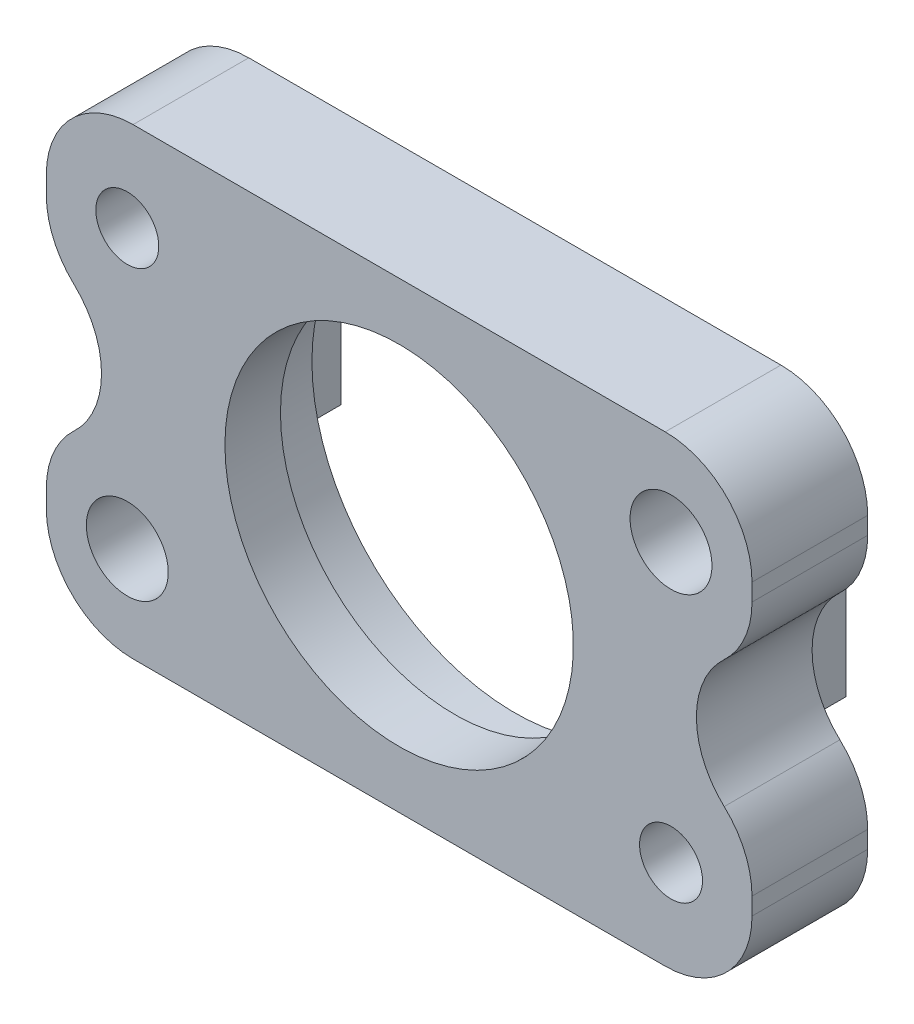
ISO-10303-21;
HEADER;
FILE_DESCRIPTION(('STEP AP214'),'2;1');
FILE_NAME('part.step','',(''),(''),'','','');
FILE_SCHEMA(('AUTOMOTIVE_DESIGN { 1 0 10303 214 1 1 1 1 }'));
ENDSEC;
DATA;
#1=APPLICATION_CONTEXT('core data for automotive mechanical design processes');
#2=APPLICATION_PROTOCOL_DEFINITION('international standard','automotive_design',2000,#1);
#3=PRODUCT_CONTEXT('',#1,'mechanical');
#4=PRODUCT('Part','Part','',(#3));
#5=PRODUCT_RELATED_PRODUCT_CATEGORY('part','',(#4));
#6=PRODUCT_DEFINITION_FORMATION('','',#4);
#7=PRODUCT_DEFINITION_CONTEXT('part definition',#1,'design');
#8=PRODUCT_DEFINITION('design','',#6,#7);
#9=PRODUCT_DEFINITION_SHAPE('','',#8);
#10=(LENGTH_UNIT() NAMED_UNIT(*) SI_UNIT(.MILLI.,.METRE.));
#11=(NAMED_UNIT(*) PLANE_ANGLE_UNIT() SI_UNIT($,.RADIAN.));
#12=(NAMED_UNIT(*) SI_UNIT($,.STERADIAN.) SOLID_ANGLE_UNIT());
#13=UNCERTAINTY_MEASURE_WITH_UNIT(LENGTH_MEASURE(1.E-05),#10,'distance_accuracy_value','');
#14=(GEOMETRIC_REPRESENTATION_CONTEXT(3) GLOBAL_UNCERTAINTY_ASSIGNED_CONTEXT((#13)) GLOBAL_UNIT_ASSIGNED_CONTEXT((#10,
#11,#12)) REPRESENTATION_CONTEXT('',''));
#15=CARTESIAN_POINT('',(0.,0.,0.));
#16=DIRECTION('',(0.,0.,1.));
#17=DIRECTION('',(1.,0.,0.));
#18=AXIS2_PLACEMENT_3D('',#15,#16,#17);
#19=CARTESIAN_POINT('',(0.,0.,0.));
#20=DIRECTION('',(0.,0.,1.));
#21=DIRECTION('',(1.,0.,0.));
#22=AXIS2_PLACEMENT_3D('',#19,#20,#21);
#23=PLANE('',#22);
#24=CARTESIAN_POINT('',(-219.71,17.78,0.));
#25=DIRECTION('',(0.,0.,1.));
#26=DIRECTION('',(1.,0.,0.));
#27=AXIS2_PLACEMENT_3D('',#24,#25,#26);
#28=CIRCLE('',#27,1.72720000000001);
#29=CARTESIAN_POINT('',(-217.9828,17.78,0.));
#30=VERTEX_POINT('',#29);
#31=EDGE_CURVE('E322',#30,#30,#28,.T.);
#32=ORIENTED_EDGE('',*,*,#31,.T.);
#33=EDGE_LOOP('',(#32));
#34=FACE_BOUND('',#33,.T.);
#35=CARTESIAN_POINT('',(-249.555,33.02,0.));
#36=DIRECTION('',(0.,0.,1.));
#37=DIRECTION('',(1.,0.,0.));
#38=AXIS2_PLACEMENT_3D('',#35,#36,#37);
#39=CIRCLE('',#38,1.72720000000001);
#40=CARTESIAN_POINT('',(-247.8278,33.02,0.));
#41=VERTEX_POINT('',#40);
#42=EDGE_CURVE('E318',#41,#41,#39,.T.);
#43=ORIENTED_EDGE('',*,*,#42,.T.);
#44=EDGE_LOOP('',(#43));
#45=FACE_BOUND('',#44,.T.);
#46=CARTESIAN_POINT('',(-249.555,17.78,0.));
#47=DIRECTION('',(0.,0.,1.));
#48=DIRECTION('',(1.,0.,0.));
#49=AXIS2_PLACEMENT_3D('',#46,#47,#48);
#50=CIRCLE('',#49,2.2479);
#51=CARTESIAN_POINT('',(-247.3071,17.78,0.));
#52=VERTEX_POINT('',#51);
#53=EDGE_CURVE('E796',#52,#52,#50,.T.);
#54=ORIENTED_EDGE('',*,*,#53,.T.);
#55=EDGE_LOOP('',(#54));
#56=FACE_BOUND('',#55,.T.);
#57=CARTESIAN_POINT('',(-219.71,33.02,0.));
#58=DIRECTION('',(0.,0.,1.));
#59=DIRECTION('',(1.,0.,0.));
#60=AXIS2_PLACEMENT_3D('',#57,#58,#59);
#61=CIRCLE('',#60,2.2479);
#62=CARTESIAN_POINT('',(-217.4621,33.02,0.));
#63=VERTEX_POINT('',#62);
#64=EDGE_CURVE('E792',#63,#63,#61,.T.);
#65=ORIENTED_EDGE('',*,*,#64,.T.);
#66=EDGE_LOOP('',(#65));
#67=FACE_BOUND('',#66,.T.);
#68=CARTESIAN_POINT('',(-234.6325,25.4,0.));
#69=DIRECTION('',(0.,0.,-1.));
#70=DIRECTION('',(-1.,0.,0.));
#71=AXIS2_PLACEMENT_3D('',#68,#69,#70);
#72=CIRCLE('',#71,11.1379);
#73=CARTESIAN_POINT('',(-245.7704,25.4,0.));
#74=VERTEX_POINT('',#73);
#75=EDGE_CURVE('E788',#74,#74,#72,.T.);
#76=ORIENTED_EDGE('',*,*,#75,.F.);
#77=EDGE_LOOP('',(#76));
#78=FACE_BOUND('',#77,.T.);
#79=DIRECTION('',(0.,1.,0.));
#80=VECTOR('',#79,1.);
#81=CARTESIAN_POINT('',(-221.9071,29.845,0.));
#82=LINE('',#81,#80);
#83=CARTESIAN_POINT('',(-221.9071,20.955,0.));
#84=VERTEX_POINT('',#83);
#85=CARTESIAN_POINT('',(-221.9071,29.845,0.));
#86=VERTEX_POINT('',#85);
#87=EDGE_CURVE('E221',#84,#86,#82,.T.);
#88=ORIENTED_EDGE('',*,*,#87,.F.);
#89=DIRECTION('',(-1.,0.,0.));
#90=VECTOR('',#89,1.);
#91=CARTESIAN_POINT('',(-221.9071,20.955,0.));
#92=LINE('',#91,#90);
#93=CARTESIAN_POINT('',(-219.6211,20.955,0.));
#94=VERTEX_POINT('',#93);
#95=EDGE_CURVE('E238',#94,#84,#92,.T.);
#96=ORIENTED_EDGE('',*,*,#95,.F.);
#97=DIRECTION('',(0.,-1.,0.));
#98=VECTOR('',#97,1.);
#99=CARTESIAN_POINT('',(-219.6211,20.955,0.));
#100=LINE('',#99,#98);
#101=CARTESIAN_POINT('',(-219.6211,29.845,0.));
#102=VERTEX_POINT('',#101);
#103=EDGE_CURVE('E250',#102,#94,#100,.T.);
#104=ORIENTED_EDGE('',*,*,#103,.F.);
#105=DIRECTION('',(1.,0.,0.));
#106=VECTOR('',#105,1.);
#107=CARTESIAN_POINT('',(-219.6211,29.845,0.));
#108=LINE('',#107,#106);
#109=EDGE_CURVE('E226',#86,#102,#108,.T.);
#110=ORIENTED_EDGE('',*,*,#109,.F.);
#111=EDGE_LOOP('',(#88,#96,#104,#110));
#112=FACE_BOUND('',#111,.T.);
#113=DIRECTION('',(0.,-1.,0.));
#114=VECTOR('',#113,1.);
#115=CARTESIAN_POINT('',(-254.,38.1,0.));
#116=LINE('',#115,#114);
#117=CARTESIAN_POINT('',(-254.,18.4270461422848,0.));
#118=VERTEX_POINT('',#117);
#119=CARTESIAN_POINT('',(-254.,17.4625,0.));
#120=VERTEX_POINT('',#119);
#121=EDGE_CURVE('E297',#118,#120,#116,.T.);
#122=ORIENTED_EDGE('',*,*,#121,.F.);
#123=CARTESIAN_POINT('',(-249.2375,18.4270461422848,0.));
#124=DIRECTION('',(0.,0.,1.));
#125=DIRECTION('',(1.,0.,0.));
#126=AXIS2_PLACEMENT_3D('',#123,#124,#125);
#127=CIRCLE('',#126,4.7625);
#128=CARTESIAN_POINT('',(-252.486843762027,21.9088806251652,0.));
#129=VERTEX_POINT('',#128);
#130=EDGE_CURVE('E343',#118,#129,#127,.F.);
#131=ORIENTED_EDGE('',*,*,#130,.T.);
#132=CARTESIAN_POINT('',(-255.744852440753,25.4,0.));
#133=DIRECTION('',(0.,0.,-1.));
#134=DIRECTION('',(-1.,0.,0.));
#135=AXIS2_PLACEMENT_3D('',#132,#133,#134);
#136=CIRCLE('',#135,4.7752);
#137=CARTESIAN_POINT('',(-252.486843762027,28.8911193748348,0.));
#138=VERTEX_POINT('',#137);
#139=EDGE_CURVE('E264',#138,#129,#136,.T.);
#140=ORIENTED_EDGE('',*,*,#139,.F.);
#141=CARTESIAN_POINT('',(-249.2375,32.3729538577152,0.));
#142=DIRECTION('',(0.,0.,1.));
#143=DIRECTION('',(1.,0.,0.));
#144=AXIS2_PLACEMENT_3D('',#141,#142,#143);
#145=CIRCLE('',#144,4.7625);
#146=CARTESIAN_POINT('',(-254.,32.3729538577152,0.));
#147=VERTEX_POINT('',#146);
#148=EDGE_CURVE('E341',#138,#147,#145,.F.);
#149=ORIENTED_EDGE('',*,*,#148,.T.);
#150=CARTESIAN_POINT('',(-254.,33.3375,0.));
#151=VERTEX_POINT('',#150);
#152=EDGE_CURVE('E300',#151,#147,#116,.T.);
#153=ORIENTED_EDGE('',*,*,#152,.F.);
#154=CARTESIAN_POINT('',(-249.2375,33.3375,0.));
#155=DIRECTION('',(0.,0.,1.));
#156=DIRECTION('',(1.,0.,0.));
#157=AXIS2_PLACEMENT_3D('',#154,#155,#156);
#158=CIRCLE('',#157,4.7625);
#159=CARTESIAN_POINT('',(-249.2375,38.1,0.));
#160=VERTEX_POINT('',#159);
#161=EDGE_CURVE('E334',#151,#160,#158,.F.);
#162=ORIENTED_EDGE('',*,*,#161,.T.);
#163=DIRECTION('',(-1.,0.,0.));
#164=VECTOR('',#163,1.);
#165=CARTESIAN_POINT('',(-215.265,38.1,0.));
#166=LINE('',#165,#164);
#167=CARTESIAN_POINT('',(-220.0275,38.1,0.));
#168=VERTEX_POINT('',#167);
#169=EDGE_CURVE('E306',#168,#160,#166,.T.);
#170=ORIENTED_EDGE('',*,*,#169,.F.);
#171=CARTESIAN_POINT('',(-220.0275,33.3375,0.));
#172=DIRECTION('',(0.,0.,1.));
#173=DIRECTION('',(1.,0.,0.));
#174=AXIS2_PLACEMENT_3D('',#171,#172,#173);
#175=CIRCLE('',#174,4.7625);
#176=CARTESIAN_POINT('',(-215.265,33.3375,0.));
#177=VERTEX_POINT('',#176);
#178=EDGE_CURVE('E337',#168,#177,#175,.F.);
#179=ORIENTED_EDGE('',*,*,#178,.T.);
#180=DIRECTION('',(0.,1.,0.));
#181=VECTOR('',#180,1.);
#182=CARTESIAN_POINT('',(-215.265,12.7,0.));
#183=LINE('',#182,#181);
#184=CARTESIAN_POINT('',(-215.265,32.3882107441622,0.));
#185=VERTEX_POINT('',#184);
#186=EDGE_CURVE('E303',#185,#177,#183,.T.);
#187=ORIENTED_EDGE('',*,*,#186,.F.);
#188=CARTESIAN_POINT('',(-220.0275,32.3882107441622,0.));
#189=DIRECTION('',(0.,0.,1.));
#190=DIRECTION('',(1.,0.,0.));
#191=AXIS2_PLACEMENT_3D('',#188,#189,#190);
#192=CIRCLE('',#191,4.76249999999995);
#193=CARTESIAN_POINT('',(-216.791355086867,28.8941053720811,0.));
#194=VERTEX_POINT('',#193);
#195=EDGE_CURVE('E270',#194,#185,#192,.T.);
#196=ORIENTED_EDGE('',*,*,#195,.F.);
#197=CARTESIAN_POINT('',(-213.555210173735,25.4,0.));
#198=DIRECTION('',(0.,0.,-1.));
#199=DIRECTION('',(-1.,0.,0.));
#200=AXIS2_PLACEMENT_3D('',#197,#198,#199);
#201=CIRCLE('',#200,4.76249999999994);
#202=CARTESIAN_POINT('',(-216.791355086867,21.9058946279189,0.));
#203=VERTEX_POINT('',#202);
#204=EDGE_CURVE('E274',#203,#194,#201,.T.);
#205=ORIENTED_EDGE('',*,*,#204,.F.);
#206=CARTESIAN_POINT('',(-220.0275,18.4117892558378,0.));
#207=DIRECTION('',(0.,0.,1.));
#208=DIRECTION('',(1.,0.,0.));
#209=AXIS2_PLACEMENT_3D('',#206,#207,#208);
#210=CIRCLE('',#209,4.76249999999995);
#211=CARTESIAN_POINT('',(-215.265,18.4117892558378,0.));
#212=VERTEX_POINT('',#211);
#213=EDGE_CURVE('E285',#212,#203,#210,.T.);
#214=ORIENTED_EDGE('',*,*,#213,.F.);
#215=CARTESIAN_POINT('',(-215.265,17.4625,0.));
#216=VERTEX_POINT('',#215);
#217=EDGE_CURVE('E302',#216,#212,#183,.T.);
#218=ORIENTED_EDGE('',*,*,#217,.F.);
#219=CARTESIAN_POINT('',(-220.0275,17.4625,0.));
#220=DIRECTION('',(0.,0.,1.));
#221=DIRECTION('',(1.,0.,0.));
#222=AXIS2_PLACEMENT_3D('',#219,#220,#221);
#223=CIRCLE('',#222,4.7625);
#224=CARTESIAN_POINT('',(-220.0275,12.7,0.));
#225=VERTEX_POINT('',#224);
#226=EDGE_CURVE('E338',#216,#225,#223,.F.);
#227=ORIENTED_EDGE('',*,*,#226,.T.);
#228=DIRECTION('',(1.,0.,0.));
#229=VECTOR('',#228,1.);
#230=CARTESIAN_POINT('',(-254.,12.7,0.));
#231=LINE('',#230,#229);
#232=CARTESIAN_POINT('',(-249.2375,12.7,0.));
#233=VERTEX_POINT('',#232);
#234=EDGE_CURVE('E299',#233,#225,#231,.T.);
#235=ORIENTED_EDGE('',*,*,#234,.F.);
#236=CARTESIAN_POINT('',(-249.2375,17.4625,0.));
#237=DIRECTION('',(0.,0.,1.));
#238=DIRECTION('',(1.,0.,0.));
#239=AXIS2_PLACEMENT_3D('',#236,#237,#238);
#240=CIRCLE('',#239,4.7625);
#241=EDGE_CURVE('E336',#233,#120,#240,.F.);
#242=ORIENTED_EDGE('',*,*,#241,.T.);
#243=EDGE_LOOP('',(#122,#131,#140,#149,#153,#162,#170,#179,#187,#196,#205,#214,#218,#227,#235,#242));
#244=FACE_BOUND('',#243,.T.);
#245=DIRECTION('',(0.,1.,0.));
#246=VECTOR('',#245,1.);
#247=CARTESIAN_POINT('',(-249.6439,29.845,0.));
#248=LINE('',#247,#246);
#249=CARTESIAN_POINT('',(-249.6439,20.955,0.));
#250=VERTEX_POINT('',#249);
#251=CARTESIAN_POINT('',(-249.6439,29.845,0.));
#252=VERTEX_POINT('',#251);
#253=EDGE_CURVE('E224',#250,#252,#248,.T.);
#254=ORIENTED_EDGE('',*,*,#253,.F.);
#255=DIRECTION('',(-1.,0.,0.));
#256=VECTOR('',#255,1.);
#257=CARTESIAN_POINT('',(-249.6439,20.955,0.));
#258=LINE('',#257,#256);
#259=CARTESIAN_POINT('',(-247.3579,20.955,0.));
#260=VERTEX_POINT('',#259);
#261=EDGE_CURVE('E222',#260,#250,#258,.T.);
#262=ORIENTED_EDGE('',*,*,#261,.F.);
#263=DIRECTION('',(0.,-1.,0.));
#264=VECTOR('',#263,1.);
#265=CARTESIAN_POINT('',(-247.3579,20.955,0.));
#266=LINE('',#265,#264);
#267=CARTESIAN_POINT('',(-247.3579,29.845,0.));
#268=VERTEX_POINT('',#267);
#269=EDGE_CURVE('E766',#268,#260,#266,.T.);
#270=ORIENTED_EDGE('',*,*,#269,.F.);
#271=DIRECTION('',(1.,0.,0.));
#272=VECTOR('',#271,1.);
#273=CARTESIAN_POINT('',(-247.3579,29.845,0.));
#274=LINE('',#273,#272);
#275=EDGE_CURVE('E767',#252,#268,#274,.T.);
#276=ORIENTED_EDGE('',*,*,#275,.F.);
#277=EDGE_LOOP('',(#254,#262,#270,#276));
#278=FACE_BOUND('',#277,.T.);
#279=ADVANCED_FACE('F39',(#34,#45,#56,#67,#78,#112,#244,#278),#23,.F.);
#280=CARTESIAN_POINT('',(-254.,38.1,0.));
#281=DIRECTION('',(-1.,0.,0.));
#282=DIRECTION('',(0.,0.,1.));
#283=AXIS2_PLACEMENT_3D('',#280,#281,#282);
#284=PLANE('',#283);
#285=ORIENTED_EDGE('',*,*,#152,.T.);
#286=DIRECTION('',(0.,0.,1.));
#287=VECTOR('',#286,1.);
#288=CARTESIAN_POINT('',(-254.,32.3729538577152,6.35));
#289=LINE('',#288,#287);
#290=CARTESIAN_POINT('',(-254.,32.3729538577152,6.35));
#291=VERTEX_POINT('',#290);
#292=EDGE_CURVE('E53',#147,#291,#289,.T.);
#293=ORIENTED_EDGE('',*,*,#292,.T.);
#294=DIRECTION('',(0.,-1.,0.));
#295=VECTOR('',#294,1.);
#296=CARTESIAN_POINT('',(-254.,38.1,6.35));
#297=LINE('',#296,#295);
#298=CARTESIAN_POINT('',(-254.,33.3375,6.35));
#299=VERTEX_POINT('',#298);
#300=EDGE_CURVE('E309',#299,#291,#297,.T.);
#301=ORIENTED_EDGE('',*,*,#300,.F.);
#302=DIRECTION('',(0.,0.,1.));
#303=VECTOR('',#302,1.);
#304=CARTESIAN_POINT('',(-254.,33.3375,0.));
#305=LINE('',#304,#303);
#306=EDGE_CURVE('E365',#299,#151,#305,.F.);
#307=ORIENTED_EDGE('',*,*,#306,.T.);
#308=EDGE_LOOP('',(#285,#293,#301,#307));
#309=FACE_BOUND('',#308,.T.);
#310=ADVANCED_FACE('F402',(#309),#284,.T.);
#311=CARTESIAN_POINT('',(-215.265,12.7,0.));
#312=DIRECTION('',(1.,0.,0.));
#313=DIRECTION('',(0.,0.,-1.));
#314=AXIS2_PLACEMENT_3D('',#311,#312,#313);
#315=PLANE('',#314);
#316=DIRECTION('',(0.,1.,0.));
#317=VECTOR('',#316,1.);
#318=CARTESIAN_POINT('',(-215.265,12.7,6.35));
#319=LINE('',#318,#317);
#320=CARTESIAN_POINT('',(-215.265,17.4625,6.35));
#321=VERTEX_POINT('',#320);
#322=CARTESIAN_POINT('',(-215.265,18.4117892558378,6.35));
#323=VERTEX_POINT('',#322);
#324=EDGE_CURVE('E317',#321,#323,#319,.T.);
#325=ORIENTED_EDGE('',*,*,#324,.F.);
#326=DIRECTION('',(0.,0.,1.));
#327=VECTOR('',#326,1.);
#328=CARTESIAN_POINT('',(-215.265,17.4625,0.));
#329=LINE('',#328,#327);
#330=EDGE_CURVE('E369',#321,#216,#329,.F.);
#331=ORIENTED_EDGE('',*,*,#330,.T.);
#332=ORIENTED_EDGE('',*,*,#217,.T.);
#333=DIRECTION('',(0.,0.,-1.));
#334=VECTOR('',#333,1.);
#335=CARTESIAN_POINT('',(-215.265,18.4117892558378,6.35));
#336=LINE('',#335,#334);
#337=EDGE_CURVE('E292',#323,#212,#336,.T.);
#338=ORIENTED_EDGE('',*,*,#337,.F.);
#339=EDGE_LOOP('',(#325,#331,#332,#338));
#340=FACE_BOUND('',#339,.T.);
#341=ADVANCED_FACE('F437',(#340),#315,.T.);
#342=CARTESIAN_POINT('',(-254.,18.4270461422848,6.35));
#343=VERTEX_POINT('',#342);
#344=CARTESIAN_POINT('',(-254.,17.4625,6.35));
#345=VERTEX_POINT('',#344);
#346=EDGE_CURVE('E289',#343,#345,#297,.T.);
#347=ORIENTED_EDGE('',*,*,#346,.F.);
#348=DIRECTION('',(0.,0.,1.));
#349=VECTOR('',#348,1.);
#350=CARTESIAN_POINT('',(-254.,18.4270461422848,0.));
#351=LINE('',#350,#349);
#352=EDGE_CURVE('E332',#343,#118,#351,.F.);
#353=ORIENTED_EDGE('',*,*,#352,.T.);
#354=ORIENTED_EDGE('',*,*,#121,.T.);
#355=DIRECTION('',(0.,0.,1.));
#356=VECTOR('',#355,1.);
#357=CARTESIAN_POINT('',(-254.,17.4625,0.));
#358=LINE('',#357,#356);
#359=EDGE_CURVE('E307',#120,#345,#358,.T.);
#360=ORIENTED_EDGE('',*,*,#359,.T.);
#361=EDGE_LOOP('',(#347,#353,#354,#360));
#362=FACE_BOUND('',#361,.T.);
#363=ADVANCED_FACE('F418',(#362),#284,.T.);
#364=CARTESIAN_POINT('',(-215.265,38.1,0.));
#365=DIRECTION('',(0.,1.,0.));
#366=DIRECTION('',(0.,0.,1.));
#367=AXIS2_PLACEMENT_3D('',#364,#365,#366);
#368=PLANE('',#367);
#369=DIRECTION('',(-1.,0.,0.));
#370=VECTOR('',#369,1.);
#371=CARTESIAN_POINT('',(-215.265,38.1,6.35));
#372=LINE('',#371,#370);
#373=CARTESIAN_POINT('',(-220.0275,38.1,6.35));
#374=VERTEX_POINT('',#373);
#375=CARTESIAN_POINT('',(-249.2375,38.1,6.35));
#376=VERTEX_POINT('',#375);
#377=EDGE_CURVE('E319',#374,#376,#372,.T.);
#378=ORIENTED_EDGE('',*,*,#377,.F.);
#379=DIRECTION('',(0.,0.,1.));
#380=VECTOR('',#379,1.);
#381=CARTESIAN_POINT('',(-220.0275,38.1,0.));
#382=LINE('',#381,#380);
#383=EDGE_CURVE('E11',#374,#168,#382,.F.);
#384=ORIENTED_EDGE('',*,*,#383,.T.);
#385=ORIENTED_EDGE('',*,*,#169,.T.);
#386=DIRECTION('',(0.,0.,1.));
#387=VECTOR('',#386,1.);
#388=CARTESIAN_POINT('',(-249.2375,38.1,0.));
#389=LINE('',#388,#387);
#390=EDGE_CURVE('E50',#160,#376,#389,.T.);
#391=ORIENTED_EDGE('',*,*,#390,.T.);
#392=EDGE_LOOP('',(#378,#384,#385,#391));
#393=FACE_BOUND('',#392,.T.);
#394=ADVANCED_FACE('F377',(#393),#368,.T.);
#395=ORIENTED_EDGE('',*,*,#186,.T.);
#396=DIRECTION('',(0.,0.,1.));
#397=VECTOR('',#396,1.);
#398=CARTESIAN_POINT('',(-215.265,33.3375,0.));
#399=LINE('',#398,#397);
#400=CARTESIAN_POINT('',(-215.265,33.3375,6.35));
#401=VERTEX_POINT('',#400);
#402=EDGE_CURVE('E375',#177,#401,#399,.T.);
#403=ORIENTED_EDGE('',*,*,#402,.T.);
#404=CARTESIAN_POINT('',(-215.265,32.3882107441622,6.35));
#405=VERTEX_POINT('',#404);
#406=EDGE_CURVE('E314',#405,#401,#319,.T.);
#407=ORIENTED_EDGE('',*,*,#406,.F.);
#408=DIRECTION('',(0.,0.,-1.));
#409=VECTOR('',#408,1.);
#410=CARTESIAN_POINT('',(-215.265,32.3882107441622,6.35));
#411=LINE('',#410,#409);
#412=EDGE_CURVE('E277',#405,#185,#411,.T.);
#413=ORIENTED_EDGE('',*,*,#412,.T.);
#414=EDGE_LOOP('',(#395,#403,#407,#413));
#415=FACE_BOUND('',#414,.T.);
#416=ADVANCED_FACE('F395',(#415),#315,.T.);
#417=CARTESIAN_POINT('',(-254.,12.7,0.));
#418=DIRECTION('',(0.,-1.,0.));
#419=DIRECTION('',(1.,0.,0.));
#420=AXIS2_PLACEMENT_3D('',#417,#418,#419);
#421=PLANE('',#420);
#422=ORIENTED_EDGE('',*,*,#234,.T.);
#423=DIRECTION('',(0.,0.,1.));
#424=VECTOR('',#423,1.);
#425=CARTESIAN_POINT('',(-220.0275,12.7,0.));
#426=LINE('',#425,#424);
#427=CARTESIAN_POINT('',(-220.0275,12.7,6.35));
#428=VERTEX_POINT('',#427);
#429=EDGE_CURVE('E370',#225,#428,#426,.T.);
#430=ORIENTED_EDGE('',*,*,#429,.T.);
#431=DIRECTION('',(1.,0.,0.));
#432=VECTOR('',#431,1.);
#433=CARTESIAN_POINT('',(-254.,12.7,6.35));
#434=LINE('',#433,#432);
#435=CARTESIAN_POINT('',(-249.2375,12.7,6.35));
#436=VERTEX_POINT('',#435);
#437=EDGE_CURVE('E315',#436,#428,#434,.T.);
#438=ORIENTED_EDGE('',*,*,#437,.F.);
#439=DIRECTION('',(0.,0.,1.));
#440=VECTOR('',#439,1.);
#441=CARTESIAN_POINT('',(-249.2375,12.7,0.));
#442=LINE('',#441,#440);
#443=EDGE_CURVE('E362',#436,#233,#442,.F.);
#444=ORIENTED_EDGE('',*,*,#443,.T.);
#445=EDGE_LOOP('',(#422,#430,#438,#444));
#446=FACE_BOUND('',#445,.T.);
#447=ADVANCED_FACE('F424',(#446),#421,.T.);
#448=CARTESIAN_POINT('',(0.,0.,6.35));
#449=DIRECTION('',(0.,0.,1.));
#450=DIRECTION('',(1.,0.,0.));
#451=AXIS2_PLACEMENT_3D('',#448,#449,#450);
#452=PLANE('',#451);
#453=CARTESIAN_POINT('',(-219.71,17.78,6.35));
#454=DIRECTION('',(0.,0.,1.));
#455=DIRECTION('',(1.,0.,0.));
#456=AXIS2_PLACEMENT_3D('',#453,#454,#455);
#457=CIRCLE('',#456,1.72720000000001);
#458=CARTESIAN_POINT('',(-217.9828,17.78,6.35));
#459=VERTEX_POINT('',#458);
#460=EDGE_CURVE('E329',#459,#459,#457,.T.);
#461=ORIENTED_EDGE('',*,*,#460,.F.);
#462=EDGE_LOOP('',(#461));
#463=FACE_BOUND('',#462,.T.);
#464=CARTESIAN_POINT('',(-249.555,33.02,6.35));
#465=DIRECTION('',(0.,0.,1.));
#466=DIRECTION('',(1.,0.,0.));
#467=AXIS2_PLACEMENT_3D('',#464,#465,#466);
#468=CIRCLE('',#467,1.72720000000001);
#469=CARTESIAN_POINT('',(-247.8278,33.02,6.35));
#470=VERTEX_POINT('',#469);
#471=EDGE_CURVE('E323',#470,#470,#468,.T.);
#472=ORIENTED_EDGE('',*,*,#471,.F.);
#473=EDGE_LOOP('',(#472));
#474=FACE_BOUND('',#473,.T.);
#475=CARTESIAN_POINT('',(-249.555,17.78,6.35));
#476=DIRECTION('',(0.,0.,1.));
#477=DIRECTION('',(1.,0.,0.));
#478=AXIS2_PLACEMENT_3D('',#475,#476,#477);
#479=CIRCLE('',#478,2.2479);
#480=CARTESIAN_POINT('',(-247.3071,17.78,6.35));
#481=VERTEX_POINT('',#480);
#482=EDGE_CURVE('E325',#481,#481,#479,.T.);
#483=ORIENTED_EDGE('',*,*,#482,.F.);
#484=EDGE_LOOP('',(#483));
#485=FACE_BOUND('',#484,.T.);
#486=CARTESIAN_POINT('',(-219.71,33.02,6.35));
#487=DIRECTION('',(0.,0.,1.));
#488=DIRECTION('',(1.,0.,0.));
#489=AXIS2_PLACEMENT_3D('',#486,#487,#488);
#490=CIRCLE('',#489,2.2479);
#491=CARTESIAN_POINT('',(-217.4621,33.02,6.35));
#492=VERTEX_POINT('',#491);
#493=EDGE_CURVE('E794',#492,#492,#490,.T.);
#494=ORIENTED_EDGE('',*,*,#493,.F.);
#495=EDGE_LOOP('',(#494));
#496=FACE_BOUND('',#495,.T.);
#497=CARTESIAN_POINT('',(-234.6325,25.4,6.34999999999999));
#498=DIRECTION('',(0.,0.,-1.));
#499=DIRECTION('',(-1.,0.,0.));
#500=AXIS2_PLACEMENT_3D('',#497,#498,#499);
#501=CIRCLE('',#500,9.56310000000002);
#502=CARTESIAN_POINT('',(-244.1956,25.4,6.34999999999999));
#503=VERTEX_POINT('',#502);
#504=EDGE_CURVE('E776',#503,#503,#501,.T.);
#505=ORIENTED_EDGE('',*,*,#504,.T.);
#506=EDGE_LOOP('',(#505));
#507=FACE_BOUND('',#506,.T.);
#508=CARTESIAN_POINT('',(-255.744852440753,25.4,6.35));
#509=DIRECTION('',(0.,0.,-1.));
#510=DIRECTION('',(-1.,0.,0.));
#511=AXIS2_PLACEMENT_3D('',#508,#509,#510);
#512=CIRCLE('',#511,4.7752);
#513=CARTESIAN_POINT('',(-252.486843762027,28.8911193748348,6.35));
#514=VERTEX_POINT('',#513);
#515=CARTESIAN_POINT('',(-252.486843762027,21.9088806251652,6.35));
#516=VERTEX_POINT('',#515);
#517=EDGE_CURVE('E261',#514,#516,#512,.T.);
#518=ORIENTED_EDGE('',*,*,#517,.T.);
#519=CARTESIAN_POINT('',(-249.2375,18.4270461422848,6.35));
#520=DIRECTION('',(0.,0.,1.));
#521=DIRECTION('',(1.,0.,0.));
#522=AXIS2_PLACEMENT_3D('',#519,#520,#521);
#523=CIRCLE('',#522,4.7625);
#524=EDGE_CURVE('E359',#516,#343,#523,.T.);
#525=ORIENTED_EDGE('',*,*,#524,.T.);
#526=ORIENTED_EDGE('',*,*,#346,.T.);
#527=CARTESIAN_POINT('',(-249.2375,17.4625,6.35));
#528=DIRECTION('',(0.,0.,1.));
#529=DIRECTION('',(1.,0.,0.));
#530=AXIS2_PLACEMENT_3D('',#527,#528,#529);
#531=CIRCLE('',#530,4.7625);
#532=EDGE_CURVE('E354',#345,#436,#531,.T.);
#533=ORIENTED_EDGE('',*,*,#532,.T.);
#534=ORIENTED_EDGE('',*,*,#437,.T.);
#535=CARTESIAN_POINT('',(-220.0275,17.4625,6.35));
#536=DIRECTION('',(0.,0.,1.));
#537=DIRECTION('',(1.,0.,0.));
#538=AXIS2_PLACEMENT_3D('',#535,#536,#537);
#539=CIRCLE('',#538,4.7625);
#540=EDGE_CURVE('E358',#428,#321,#539,.T.);
#541=ORIENTED_EDGE('',*,*,#540,.T.);
#542=ORIENTED_EDGE('',*,*,#324,.T.);
#543=CARTESIAN_POINT('',(-220.0275,18.4117892558378,6.35));
#544=DIRECTION('',(0.,0.,1.));
#545=DIRECTION('',(1.,0.,0.));
#546=AXIS2_PLACEMENT_3D('',#543,#544,#545);
#547=CIRCLE('',#546,4.76249999999995);
#548=CARTESIAN_POINT('',(-216.791355086867,21.9058946279189,6.35));
#549=VERTEX_POINT('',#548);
#550=EDGE_CURVE('E271',#323,#549,#547,.T.);
#551=ORIENTED_EDGE('',*,*,#550,.T.);
#552=CARTESIAN_POINT('',(-213.555210173735,25.4,6.35));
#553=DIRECTION('',(0.,0.,-1.));
#554=DIRECTION('',(-1.,0.,0.));
#555=AXIS2_PLACEMENT_3D('',#552,#553,#554);
#556=CIRCLE('',#555,4.76249999999994);
#557=CARTESIAN_POINT('',(-216.791355086867,28.8941053720811,6.35));
#558=VERTEX_POINT('',#557);
#559=EDGE_CURVE('E276',#549,#558,#556,.T.);
#560=ORIENTED_EDGE('',*,*,#559,.T.);
#561=CARTESIAN_POINT('',(-220.0275,32.3882107441622,6.35));
#562=DIRECTION('',(0.,0.,1.));
#563=DIRECTION('',(1.,0.,0.));
#564=AXIS2_PLACEMENT_3D('',#561,#562,#563);
#565=CIRCLE('',#564,4.76249999999995);
#566=EDGE_CURVE('E266',#558,#405,#565,.T.);
#567=ORIENTED_EDGE('',*,*,#566,.T.);
#568=ORIENTED_EDGE('',*,*,#406,.T.);
#569=CARTESIAN_POINT('',(-220.0275,33.3375,6.35));
#570=DIRECTION('',(0.,0.,1.));
#571=DIRECTION('',(1.,0.,0.));
#572=AXIS2_PLACEMENT_3D('',#569,#570,#571);
#573=CIRCLE('',#572,4.7625);
#574=EDGE_CURVE('E355',#401,#374,#573,.T.);
#575=ORIENTED_EDGE('',*,*,#574,.T.);
#576=ORIENTED_EDGE('',*,*,#377,.T.);
#577=CARTESIAN_POINT('',(-249.2375,33.3375,6.35));
#578=DIRECTION('',(0.,0.,1.));
#579=DIRECTION('',(1.,0.,0.));
#580=AXIS2_PLACEMENT_3D('',#577,#578,#579);
#581=CIRCLE('',#580,4.7625);
#582=EDGE_CURVE('E64',#376,#299,#581,.T.);
#583=ORIENTED_EDGE('',*,*,#582,.T.);
#584=ORIENTED_EDGE('',*,*,#300,.T.);
#585=CARTESIAN_POINT('',(-249.2375,32.3729538577152,6.35));
#586=DIRECTION('',(0.,0.,1.));
#587=DIRECTION('',(1.,0.,0.));
#588=AXIS2_PLACEMENT_3D('',#585,#586,#587);
#589=CIRCLE('',#588,4.7625);
#590=EDGE_CURVE('E356',#291,#514,#589,.T.);
#591=ORIENTED_EDGE('',*,*,#590,.T.);
#592=EDGE_LOOP('',(#518,#525,#526,#533,#534,#541,#542,#551,#560,#567,#568,#575,#576,#583,#584,#591));
#593=FACE_BOUND('',#592,.T.);
#594=ADVANCED_FACE('F384',(#463,#474,#485,#496,#507,#593),#452,.T.);
#595=CARTESIAN_POINT('',(-220.0275,32.3882107441622,6.35));
#596=DIRECTION('',(0.,0.,-1.));
#597=DIRECTION('',(-1.,0.,0.));
#598=AXIS2_PLACEMENT_3D('',#595,#596,#597);
#599=CYLINDRICAL_SURFACE('',#598,4.76249999999995);
#600=ORIENTED_EDGE('',*,*,#195,.T.);
#601=ORIENTED_EDGE('',*,*,#412,.F.);
#602=ORIENTED_EDGE('',*,*,#566,.F.);
#603=DIRECTION('',(0.,0.,-1.));
#604=VECTOR('',#603,1.);
#605=CARTESIAN_POINT('',(-216.791355086867,28.8941053720811,6.35));
#606=LINE('',#605,#604);
#607=EDGE_CURVE('E290',#558,#194,#606,.T.);
#608=ORIENTED_EDGE('',*,*,#607,.T.);
#609=EDGE_LOOP('',(#600,#601,#602,#608));
#610=FACE_BOUND('',#609,.T.);
#611=ADVANCED_FACE('F449',(#610),#599,.T.);
#612=CARTESIAN_POINT('',(-213.555210173735,25.4,6.35));
#613=DIRECTION('',(0.,0.,-1.));
#614=DIRECTION('',(-1.,0.,0.));
#615=AXIS2_PLACEMENT_3D('',#612,#613,#614);
#616=CYLINDRICAL_SURFACE('',#615,4.76249999999994);
#617=ORIENTED_EDGE('',*,*,#204,.T.);
#618=ORIENTED_EDGE('',*,*,#607,.F.);
#619=ORIENTED_EDGE('',*,*,#559,.F.);
#620=DIRECTION('',(0.,0.,-1.));
#621=VECTOR('',#620,1.);
#622=CARTESIAN_POINT('',(-216.791355086867,21.9058946279189,6.35));
#623=LINE('',#622,#621);
#624=EDGE_CURVE('E286',#549,#203,#623,.T.);
#625=ORIENTED_EDGE('',*,*,#624,.T.);
#626=EDGE_LOOP('',(#617,#618,#619,#625));
#627=FACE_BOUND('',#626,.T.);
#628=ADVANCED_FACE('F444',(#627),#616,.F.);
#629=CARTESIAN_POINT('',(-220.0275,18.4117892558378,6.35));
#630=DIRECTION('',(0.,0.,-1.));
#631=DIRECTION('',(-1.,0.,0.));
#632=AXIS2_PLACEMENT_3D('',#629,#630,#631);
#633=CYLINDRICAL_SURFACE('',#632,4.76249999999995);
#634=ORIENTED_EDGE('',*,*,#213,.T.);
#635=ORIENTED_EDGE('',*,*,#624,.F.);
#636=ORIENTED_EDGE('',*,*,#550,.F.);
#637=ORIENTED_EDGE('',*,*,#337,.T.);
#638=EDGE_LOOP('',(#634,#635,#636,#637));
#639=FACE_BOUND('',#638,.T.);
#640=ADVANCED_FACE('F445',(#639),#633,.T.);
#641=CARTESIAN_POINT('',(-255.744852440753,25.4,6.35));
#642=DIRECTION('',(0.,0.,-1.));
#643=DIRECTION('',(-1.,0.,0.));
#644=AXIS2_PLACEMENT_3D('',#641,#642,#643);
#645=CYLINDRICAL_SURFACE('',#644,4.7752);
#646=ORIENTED_EDGE('',*,*,#139,.T.);
#647=DIRECTION('',(0.,0.,-1.));
#648=VECTOR('',#647,1.);
#649=CARTESIAN_POINT('',(-252.486843762027,21.9088806251652,6.35));
#650=LINE('',#649,#648);
#651=EDGE_CURVE('E346',#129,#516,#650,.F.);
#652=ORIENTED_EDGE('',*,*,#651,.T.);
#653=ORIENTED_EDGE('',*,*,#517,.F.);
#654=DIRECTION('',(0.,0.,-1.));
#655=VECTOR('',#654,1.);
#656=CARTESIAN_POINT('',(-252.486843762027,28.8911193748348,6.35));
#657=LINE('',#656,#655);
#658=EDGE_CURVE('E347',#514,#138,#657,.T.);
#659=ORIENTED_EDGE('',*,*,#658,.T.);
#660=EDGE_LOOP('',(#646,#652,#653,#659));
#661=FACE_BOUND('',#660,.T.);
#662=ADVANCED_FACE('F408',(#661),#645,.F.);
#663=CARTESIAN_POINT('',(-221.9071,29.845,-3.175));
#664=DIRECTION('',(1.,0.,0.));
#665=DIRECTION('',(0.,0.,-1.));
#666=AXIS2_PLACEMENT_3D('',#663,#664,#665);
#667=PLANE('',#666);
#668=ORIENTED_EDGE('',*,*,#87,.T.);
#669=DIRECTION('',(0.,0.,1.));
#670=VECTOR('',#669,1.);
#671=CARTESIAN_POINT('',(-221.9071,29.845,-3.175));
#672=LINE('',#671,#670);
#673=CARTESIAN_POINT('',(-221.9071,29.845,-3.175));
#674=VERTEX_POINT('',#673);
#675=EDGE_CURVE('E257',#674,#86,#672,.T.);
#676=ORIENTED_EDGE('',*,*,#675,.F.);
#677=DIRECTION('',(0.,1.,0.));
#678=VECTOR('',#677,1.);
#679=CARTESIAN_POINT('',(-221.9071,29.845,-3.175));
#680=LINE('',#679,#678);
#681=CARTESIAN_POINT('',(-221.9071,20.955,-3.175));
#682=VERTEX_POINT('',#681);
#683=EDGE_CURVE('E234',#682,#674,#680,.T.);
#684=ORIENTED_EDGE('',*,*,#683,.F.);
#685=DIRECTION('',(0.,0.,1.));
#686=VECTOR('',#685,1.);
#687=CARTESIAN_POINT('',(-221.9071,20.955,-3.175));
#688=LINE('',#687,#686);
#689=EDGE_CURVE('E243',#682,#84,#688,.T.);
#690=ORIENTED_EDGE('',*,*,#689,.T.);
#691=EDGE_LOOP('',(#668,#676,#684,#690));
#692=FACE_BOUND('',#691,.T.);
#693=ADVANCED_FACE('F677',(#692),#667,.F.);
#694=CARTESIAN_POINT('',(-219.6211,29.845,-3.175));
#695=DIRECTION('',(0.,-1.,0.));
#696=DIRECTION('',(0.,0.,-1.));
#697=AXIS2_PLACEMENT_3D('',#694,#695,#696);
#698=PLANE('',#697);
#699=ORIENTED_EDGE('',*,*,#109,.T.);
#700=DIRECTION('',(0.,0.,1.));
#701=VECTOR('',#700,1.);
#702=CARTESIAN_POINT('',(-219.6211,29.845,-3.175));
#703=LINE('',#702,#701);
#704=CARTESIAN_POINT('',(-219.6211,29.845,-3.175));
#705=VERTEX_POINT('',#704);
#706=EDGE_CURVE('E256',#705,#102,#703,.T.);
#707=ORIENTED_EDGE('',*,*,#706,.F.);
#708=DIRECTION('',(1.,0.,0.));
#709=VECTOR('',#708,1.);
#710=CARTESIAN_POINT('',(-219.6211,29.845,-3.175));
#711=LINE('',#710,#709);
#712=EDGE_CURVE('E240',#674,#705,#711,.T.);
#713=ORIENTED_EDGE('',*,*,#712,.F.);
#714=ORIENTED_EDGE('',*,*,#675,.T.);
#715=EDGE_LOOP('',(#699,#707,#713,#714));
#716=FACE_BOUND('',#715,.T.);
#717=ADVANCED_FACE('F669',(#716),#698,.F.);
#718=CARTESIAN_POINT('',(-219.6211,20.955,-3.175));
#719=DIRECTION('',(-1.,0.,0.));
#720=DIRECTION('',(0.,0.,1.));
#721=AXIS2_PLACEMENT_3D('',#718,#719,#720);
#722=PLANE('',#721);
#723=ORIENTED_EDGE('',*,*,#103,.T.);
#724=DIRECTION('',(0.,0.,1.));
#725=VECTOR('',#724,1.);
#726=CARTESIAN_POINT('',(-219.6211,20.955,-3.175));
#727=LINE('',#726,#725);
#728=CARTESIAN_POINT('',(-219.6211,20.955,-3.175));
#729=VERTEX_POINT('',#728);
#730=EDGE_CURVE('E251',#729,#94,#727,.T.);
#731=ORIENTED_EDGE('',*,*,#730,.F.);
#732=DIRECTION('',(0.,-1.,0.));
#733=VECTOR('',#732,1.);
#734=CARTESIAN_POINT('',(-219.6211,20.955,-3.175));
#735=LINE('',#734,#733);
#736=EDGE_CURVE('E239',#705,#729,#735,.T.);
#737=ORIENTED_EDGE('',*,*,#736,.F.);
#738=ORIENTED_EDGE('',*,*,#706,.T.);
#739=EDGE_LOOP('',(#723,#731,#737,#738));
#740=FACE_BOUND('',#739,.T.);
#741=ADVANCED_FACE('F657',(#740),#722,.F.);
#742=CARTESIAN_POINT('',(-221.9071,20.955,-3.175));
#743=DIRECTION('',(0.,1.,0.));
#744=DIRECTION('',(0.,0.,1.));
#745=AXIS2_PLACEMENT_3D('',#742,#743,#744);
#746=PLANE('',#745);
#747=ORIENTED_EDGE('',*,*,#95,.T.);
#748=ORIENTED_EDGE('',*,*,#689,.F.);
#749=DIRECTION('',(-1.,0.,0.));
#750=VECTOR('',#749,1.);
#751=CARTESIAN_POINT('',(-221.9071,20.955,-3.175));
#752=LINE('',#751,#750);
#753=EDGE_CURVE('E245',#729,#682,#752,.T.);
#754=ORIENTED_EDGE('',*,*,#753,.F.);
#755=ORIENTED_EDGE('',*,*,#730,.T.);
#756=EDGE_LOOP('',(#747,#748,#754,#755));
#757=FACE_BOUND('',#756,.T.);
#758=ADVANCED_FACE('F649',(#757),#746,.F.);
#759=CARTESIAN_POINT('',(0.,0.,-3.175));
#760=DIRECTION('',(0.,0.,1.));
#761=DIRECTION('',(1.,0.,0.));
#762=AXIS2_PLACEMENT_3D('',#759,#760,#761);
#763=PLANE('',#762);
#764=ORIENTED_EDGE('',*,*,#683,.T.);
#765=ORIENTED_EDGE('',*,*,#712,.T.);
#766=ORIENTED_EDGE('',*,*,#736,.T.);
#767=ORIENTED_EDGE('',*,*,#753,.T.);
#768=EDGE_LOOP('',(#764,#765,#766,#767));
#769=FACE_BOUND('',#768,.T.);
#770=ADVANCED_FACE('F635',(#769),#763,.F.);
#771=CARTESIAN_POINT('',(-249.6439,29.845,-3.175));
#772=DIRECTION('',(1.,0.,0.));
#773=DIRECTION('',(0.,0.,-1.));
#774=AXIS2_PLACEMENT_3D('',#771,#772,#773);
#775=PLANE('',#774);
#776=ORIENTED_EDGE('',*,*,#253,.T.);
#777=DIRECTION('',(0.,0.,1.));
#778=VECTOR('',#777,1.);
#779=CARTESIAN_POINT('',(-249.6439,29.845,-3.175));
#780=LINE('',#779,#778);
#781=CARTESIAN_POINT('',(-249.6439,29.845,-3.175));
#782=VERTEX_POINT('',#781);
#783=EDGE_CURVE('E201',#782,#252,#780,.T.);
#784=ORIENTED_EDGE('',*,*,#783,.F.);
#785=DIRECTION('',(0.,1.,0.));
#786=VECTOR('',#785,1.);
#787=CARTESIAN_POINT('',(-249.6439,29.845,-3.175));
#788=LINE('',#787,#786);
#789=CARTESIAN_POINT('',(-249.6439,20.955,-3.175));
#790=VERTEX_POINT('',#789);
#791=EDGE_CURVE('E211',#790,#782,#788,.T.);
#792=ORIENTED_EDGE('',*,*,#791,.F.);
#793=DIRECTION('',(0.,0.,1.));
#794=VECTOR('',#793,1.);
#795=CARTESIAN_POINT('',(-249.6439,20.955,-3.175));
#796=LINE('',#795,#794);
#797=EDGE_CURVE('E772',#790,#250,#796,.T.);
#798=ORIENTED_EDGE('',*,*,#797,.T.);
#799=EDGE_LOOP('',(#776,#784,#792,#798));
#800=FACE_BOUND('',#799,.T.);
#801=ADVANCED_FACE('F223',(#800),#775,.F.);
#802=CARTESIAN_POINT('',(-247.3579,29.845,-3.175));
#803=DIRECTION('',(0.,-1.,0.));
#804=DIRECTION('',(0.,0.,-1.));
#805=AXIS2_PLACEMENT_3D('',#802,#803,#804);
#806=PLANE('',#805);
#807=ORIENTED_EDGE('',*,*,#275,.T.);
#808=DIRECTION('',(0.,0.,1.));
#809=VECTOR('',#808,1.);
#810=CARTESIAN_POINT('',(-247.3579,29.845,-3.175));
#811=LINE('',#810,#809);
#812=CARTESIAN_POINT('',(-247.3579,29.845,-3.175));
#813=VERTEX_POINT('',#812);
#814=EDGE_CURVE('E206',#813,#268,#811,.T.);
#815=ORIENTED_EDGE('',*,*,#814,.F.);
#816=DIRECTION('',(1.,0.,0.));
#817=VECTOR('',#816,1.);
#818=CARTESIAN_POINT('',(-247.3579,29.845,-3.175));
#819=LINE('',#818,#817);
#820=EDGE_CURVE('E198',#782,#813,#819,.T.);
#821=ORIENTED_EDGE('',*,*,#820,.F.);
#822=ORIENTED_EDGE('',*,*,#783,.T.);
#823=EDGE_LOOP('',(#807,#815,#821,#822));
#824=FACE_BOUND('',#823,.T.);
#825=ADVANCED_FACE('F203',(#824),#806,.F.);
#826=CARTESIAN_POINT('',(-247.3579,20.955,-3.175));
#827=DIRECTION('',(-1.,0.,0.));
#828=DIRECTION('',(0.,0.,1.));
#829=AXIS2_PLACEMENT_3D('',#826,#827,#828);
#830=PLANE('',#829);
#831=ORIENTED_EDGE('',*,*,#269,.T.);
#832=DIRECTION('',(0.,0.,1.));
#833=VECTOR('',#832,1.);
#834=CARTESIAN_POINT('',(-247.3579,20.955,-3.175));
#835=LINE('',#834,#833);
#836=CARTESIAN_POINT('',(-247.3579,20.955,-3.175));
#837=VERTEX_POINT('',#836);
#838=EDGE_CURVE('E229',#837,#260,#835,.T.);
#839=ORIENTED_EDGE('',*,*,#838,.F.);
#840=DIRECTION('',(0.,-1.,0.));
#841=VECTOR('',#840,1.);
#842=CARTESIAN_POINT('',(-247.3579,20.955,-3.175));
#843=LINE('',#842,#841);
#844=EDGE_CURVE('E214',#813,#837,#843,.T.);
#845=ORIENTED_EDGE('',*,*,#844,.F.);
#846=ORIENTED_EDGE('',*,*,#814,.T.);
#847=EDGE_LOOP('',(#831,#839,#845,#846));
#848=FACE_BOUND('',#847,.T.);
#849=ADVANCED_FACE('F607',(#848),#830,.F.);
#850=CARTESIAN_POINT('',(-249.6439,20.955,-3.175));
#851=DIRECTION('',(0.,1.,0.));
#852=DIRECTION('',(0.,0.,1.));
#853=AXIS2_PLACEMENT_3D('',#850,#851,#852);
#854=PLANE('',#853);
#855=ORIENTED_EDGE('',*,*,#261,.T.);
#856=ORIENTED_EDGE('',*,*,#797,.F.);
#857=DIRECTION('',(-1.,0.,0.));
#858=VECTOR('',#857,1.);
#859=CARTESIAN_POINT('',(-249.6439,20.955,-3.175));
#860=LINE('',#859,#858);
#861=EDGE_CURVE('E220',#837,#790,#860,.T.);
#862=ORIENTED_EDGE('',*,*,#861,.F.);
#863=ORIENTED_EDGE('',*,*,#838,.T.);
#864=EDGE_LOOP('',(#855,#856,#862,#863));
#865=FACE_BOUND('',#864,.T.);
#866=ADVANCED_FACE('F600',(#865),#854,.F.);
#867=CARTESIAN_POINT('',(0.,0.,-3.175));
#868=DIRECTION('',(0.,0.,1.));
#869=DIRECTION('',(1.,0.,0.));
#870=AXIS2_PLACEMENT_3D('',#867,#868,#869);
#871=PLANE('',#870);
#872=ORIENTED_EDGE('',*,*,#791,.T.);
#873=ORIENTED_EDGE('',*,*,#820,.T.);
#874=ORIENTED_EDGE('',*,*,#844,.T.);
#875=ORIENTED_EDGE('',*,*,#861,.T.);
#876=EDGE_LOOP('',(#872,#873,#874,#875));
#877=FACE_BOUND('',#876,.T.);
#878=ADVANCED_FACE('F212',(#877),#871,.F.);
#879=CARTESIAN_POINT('',(-234.6325,25.4,0.));
#880=DIRECTION('',(0.,0.,-1.));
#881=DIRECTION('',(-1.,0.,0.));
#882=AXIS2_PLACEMENT_3D('',#879,#880,#881);
#883=CYLINDRICAL_SURFACE('',#882,9.56310000000002);
#884=ORIENTED_EDGE('',*,*,#504,.F.);
#885=EDGE_LOOP('',(#884));
#886=FACE_BOUND('',#885,.T.);
#887=CARTESIAN_POINT('',(-234.6325,25.4,3.302));
#888=DIRECTION('',(0.,0.,-1.));
#889=DIRECTION('',(-1.,0.,0.));
#890=AXIS2_PLACEMENT_3D('',#887,#888,#889);
#891=CIRCLE('',#890,9.56310000000002);
#892=CARTESIAN_POINT('',(-244.1956,25.4,3.302));
#893=VERTEX_POINT('',#892);
#894=EDGE_CURVE('E785',#893,#893,#891,.T.);
#895=ORIENTED_EDGE('',*,*,#894,.T.);
#896=EDGE_LOOP('',(#895));
#897=FACE_BOUND('',#896,.T.);
#898=ADVANCED_FACE('F579',(#886,#897),#883,.F.);
#899=CARTESIAN_POINT('',(-225.0694,25.4,3.302));
#900=DIRECTION('',(0.,0.,1.));
#901=DIRECTION('',(1.,0.,0.));
#902=AXIS2_PLACEMENT_3D('',#899,#900,#901);
#903=PLANE('',#902);
#904=ORIENTED_EDGE('',*,*,#894,.F.);
#905=EDGE_LOOP('',(#904));
#906=FACE_BOUND('',#905,.T.);
#907=CARTESIAN_POINT('',(-234.6325,25.4,3.302));
#908=DIRECTION('',(0.,0.,-1.));
#909=DIRECTION('',(-1.,0.,0.));
#910=AXIS2_PLACEMENT_3D('',#907,#908,#909);
#911=CIRCLE('',#910,11.1379);
#912=CARTESIAN_POINT('',(-245.7704,25.4,3.302));
#913=VERTEX_POINT('',#912);
#914=EDGE_CURVE('E783',#913,#913,#911,.T.);
#915=ORIENTED_EDGE('',*,*,#914,.T.);
#916=EDGE_LOOP('',(#915));
#917=FACE_BOUND('',#916,.T.);
#918=ADVANCED_FACE('F568',(#906,#917),#903,.F.);
#919=CARTESIAN_POINT('',(-234.6325,25.4,0.));
#920=DIRECTION('',(0.,0.,-1.));
#921=DIRECTION('',(-1.,0.,0.));
#922=AXIS2_PLACEMENT_3D('',#919,#920,#921);
#923=CYLINDRICAL_SURFACE('',#922,11.1379);
#924=ORIENTED_EDGE('',*,*,#914,.F.);
#925=EDGE_LOOP('',(#924));
#926=FACE_BOUND('',#925,.T.);
#927=ORIENTED_EDGE('',*,*,#75,.T.);
#928=EDGE_LOOP('',(#927));
#929=FACE_BOUND('',#928,.T.);
#930=ADVANCED_FACE('F556',(#926,#929),#923,.F.);
#931=CARTESIAN_POINT('',(-219.71,33.02,6.35));
#932=DIRECTION('',(0.,0.,1.));
#933=DIRECTION('',(1.,0.,0.));
#934=AXIS2_PLACEMENT_3D('',#931,#932,#933);
#935=CYLINDRICAL_SURFACE('',#934,2.2479);
#936=ORIENTED_EDGE('',*,*,#493,.T.);
#937=EDGE_LOOP('',(#936));
#938=FACE_BOUND('',#937,.T.);
#939=ORIENTED_EDGE('',*,*,#64,.F.);
#940=EDGE_LOOP('',(#939));
#941=FACE_BOUND('',#940,.T.);
#942=ADVANCED_FACE('F548',(#938,#941),#935,.F.);
#943=CARTESIAN_POINT('',(-249.555,17.78,6.35));
#944=DIRECTION('',(0.,0.,1.));
#945=DIRECTION('',(1.,0.,0.));
#946=AXIS2_PLACEMENT_3D('',#943,#944,#945);
#947=CYLINDRICAL_SURFACE('',#946,2.2479);
#948=ORIENTED_EDGE('',*,*,#482,.T.);
#949=EDGE_LOOP('',(#948));
#950=FACE_BOUND('',#949,.T.);
#951=ORIENTED_EDGE('',*,*,#53,.F.);
#952=EDGE_LOOP('',(#951));
#953=FACE_BOUND('',#952,.T.);
#954=ADVANCED_FACE('F540',(#950,#953),#947,.F.);
#955=CARTESIAN_POINT('',(-249.555,33.02,6.35));
#956=DIRECTION('',(0.,0.,1.));
#957=DIRECTION('',(1.,0.,0.));
#958=AXIS2_PLACEMENT_3D('',#955,#956,#957);
#959=CYLINDRICAL_SURFACE('',#958,1.72720000000001);
#960=ORIENTED_EDGE('',*,*,#471,.T.);
#961=EDGE_LOOP('',(#960));
#962=FACE_BOUND('',#961,.T.);
#963=ORIENTED_EDGE('',*,*,#42,.F.);
#964=EDGE_LOOP('',(#963));
#965=FACE_BOUND('',#964,.T.);
#966=ADVANCED_FACE('F528',(#962,#965),#959,.F.);
#967=CARTESIAN_POINT('',(-219.71,17.78,6.35));
#968=DIRECTION('',(0.,0.,1.));
#969=DIRECTION('',(1.,0.,0.));
#970=AXIS2_PLACEMENT_3D('',#967,#968,#969);
#971=CYLINDRICAL_SURFACE('',#970,1.72720000000001);
#972=ORIENTED_EDGE('',*,*,#460,.T.);
#973=EDGE_LOOP('',(#972));
#974=FACE_BOUND('',#973,.T.);
#975=ORIENTED_EDGE('',*,*,#31,.F.);
#976=EDGE_LOOP('',(#975));
#977=FACE_BOUND('',#976,.T.);
#978=ADVANCED_FACE('F479',(#974,#977),#971,.F.);
#979=CARTESIAN_POINT('',(-249.2375,18.4270461422848,6.35));
#980=DIRECTION('',(0.,0.,-1.));
#981=DIRECTION('',(-1.,0.,0.));
#982=AXIS2_PLACEMENT_3D('',#979,#980,#981);
#983=CYLINDRICAL_SURFACE('',#982,4.7625);
#984=ORIENTED_EDGE('',*,*,#524,.F.);
#985=ORIENTED_EDGE('',*,*,#651,.F.);
#986=ORIENTED_EDGE('',*,*,#130,.F.);
#987=ORIENTED_EDGE('',*,*,#352,.F.);
#988=EDGE_LOOP('',(#984,#985,#986,#987));
#989=FACE_BOUND('',#988,.T.);
#990=ADVANCED_FACE('F413',(#989),#983,.T.);
#991=CARTESIAN_POINT('',(-249.2375,32.3729538577152,6.35));
#992=DIRECTION('',(0.,0.,-1.));
#993=DIRECTION('',(-1.,0.,0.));
#994=AXIS2_PLACEMENT_3D('',#991,#992,#993);
#995=CYLINDRICAL_SURFACE('',#994,4.7625);
#996=ORIENTED_EDGE('',*,*,#590,.F.);
#997=ORIENTED_EDGE('',*,*,#292,.F.);
#998=ORIENTED_EDGE('',*,*,#148,.F.);
#999=ORIENTED_EDGE('',*,*,#658,.F.);
#1000=EDGE_LOOP('',(#996,#997,#998,#999));
#1001=FACE_BOUND('',#1000,.T.);
#1002=ADVANCED_FACE('F409',(#1001),#995,.T.);
#1003=CARTESIAN_POINT('',(-220.0275,17.4625,0.));
#1004=DIRECTION('',(0.,0.,1.));
#1005=DIRECTION('',(1.,0.,0.));
#1006=AXIS2_PLACEMENT_3D('',#1003,#1004,#1005);
#1007=CYLINDRICAL_SURFACE('',#1006,4.7625);
#1008=ORIENTED_EDGE('',*,*,#226,.F.);
#1009=ORIENTED_EDGE('',*,*,#330,.F.);
#1010=ORIENTED_EDGE('',*,*,#540,.F.);
#1011=ORIENTED_EDGE('',*,*,#429,.F.);
#1012=EDGE_LOOP('',(#1008,#1009,#1010,#1011));
#1013=FACE_BOUND('',#1012,.T.);
#1014=ADVANCED_FACE('F433',(#1013),#1007,.T.);
#1015=CARTESIAN_POINT('',(-249.2375,17.4625,0.));
#1016=DIRECTION('',(0.,0.,1.));
#1017=DIRECTION('',(1.,0.,0.));
#1018=AXIS2_PLACEMENT_3D('',#1015,#1016,#1017);
#1019=CYLINDRICAL_SURFACE('',#1018,4.7625);
#1020=ORIENTED_EDGE('',*,*,#241,.F.);
#1021=ORIENTED_EDGE('',*,*,#443,.F.);
#1022=ORIENTED_EDGE('',*,*,#532,.F.);
#1023=ORIENTED_EDGE('',*,*,#359,.F.);
#1024=EDGE_LOOP('',(#1020,#1021,#1022,#1023));
#1025=FACE_BOUND('',#1024,.T.);
#1026=ADVANCED_FACE('F429',(#1025),#1019,.T.);
#1027=CARTESIAN_POINT('',(-220.0275,33.3375,0.));
#1028=DIRECTION('',(0.,0.,1.));
#1029=DIRECTION('',(1.,0.,0.));
#1030=AXIS2_PLACEMENT_3D('',#1027,#1028,#1029);
#1031=CYLINDRICAL_SURFACE('',#1030,4.7625);
#1032=ORIENTED_EDGE('',*,*,#178,.F.);
#1033=ORIENTED_EDGE('',*,*,#383,.F.);
#1034=ORIENTED_EDGE('',*,*,#574,.F.);
#1035=ORIENTED_EDGE('',*,*,#402,.F.);
#1036=EDGE_LOOP('',(#1032,#1033,#1034,#1035));
#1037=FACE_BOUND('',#1036,.T.);
#1038=ADVANCED_FACE('F388',(#1037),#1031,.T.);
#1039=CARTESIAN_POINT('',(-249.2375,33.3375,0.));
#1040=DIRECTION('',(0.,0.,1.));
#1041=DIRECTION('',(1.,0.,0.));
#1042=AXIS2_PLACEMENT_3D('',#1039,#1040,#1041);
#1043=CYLINDRICAL_SURFACE('',#1042,4.7625);
#1044=ORIENTED_EDGE('',*,*,#161,.F.);
#1045=ORIENTED_EDGE('',*,*,#306,.F.);
#1046=ORIENTED_EDGE('',*,*,#582,.F.);
#1047=ORIENTED_EDGE('',*,*,#390,.F.);
#1048=EDGE_LOOP('',(#1044,#1045,#1046,#1047));
#1049=FACE_BOUND('',#1048,.T.);
#1050=ADVANCED_FACE('F41',(#1049),#1043,.T.);
#1051=CLOSED_SHELL('',(#279,#310,#341,#363,#394,#416,#447,#594,#611,#628,#640,#662,#693,#717,
#741,#758,#770,#801,#825,#849,#866,#878,#898,#918,#930,#942,#954,#966,#978,#990,#1002,#1014,
#1026,#1038,#1050));
#1052=MANIFOLD_SOLID_BREP('B2',#1051);
#1053=ADVANCED_BREP_SHAPE_REPRESENTATION('',(#18,#1052),#14);
#1054=SHAPE_DEFINITION_REPRESENTATION(#9,#1053);
ENDSEC;
END-ISO-10303-21;
